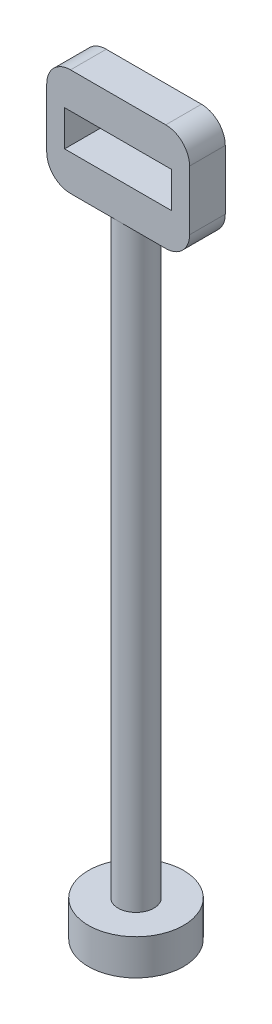
ISO-10303-21;
HEADER;
FILE_DESCRIPTION(('STEP AP214'),'2;1');
FILE_NAME('part.step','',(''),(''),'','','');
FILE_SCHEMA(('AUTOMOTIVE_DESIGN { 1 0 10303 214 1 1 1 1 }'));
ENDSEC;
DATA;
#1=APPLICATION_CONTEXT('core data for automotive mechanical design processes');
#2=APPLICATION_PROTOCOL_DEFINITION('international standard','automotive_design',2000,#1);
#3=PRODUCT_CONTEXT('',#1,'mechanical');
#4=PRODUCT('Part','Part','',(#3));
#5=PRODUCT_RELATED_PRODUCT_CATEGORY('part','',(#4));
#6=PRODUCT_DEFINITION_FORMATION('','',#4);
#7=PRODUCT_DEFINITION_CONTEXT('part definition',#1,'design');
#8=PRODUCT_DEFINITION('design','',#6,#7);
#9=PRODUCT_DEFINITION_SHAPE('','',#8);
#10=(LENGTH_UNIT() NAMED_UNIT(*) SI_UNIT(.MILLI.,.METRE.));
#11=(NAMED_UNIT(*) PLANE_ANGLE_UNIT() SI_UNIT($,.RADIAN.));
#12=(NAMED_UNIT(*) SI_UNIT($,.STERADIAN.) SOLID_ANGLE_UNIT());
#13=UNCERTAINTY_MEASURE_WITH_UNIT(LENGTH_MEASURE(1.E-05),#10,'distance_accuracy_value','');
#14=(GEOMETRIC_REPRESENTATION_CONTEXT(3) GLOBAL_UNCERTAINTY_ASSIGNED_CONTEXT((#13)) GLOBAL_UNIT_ASSIGNED_CONTEXT((#10,
#11,#12)) REPRESENTATION_CONTEXT('',''));
#15=CARTESIAN_POINT('',(0.,0.,0.));
#16=DIRECTION('',(0.,0.,1.));
#17=DIRECTION('',(1.,0.,0.));
#18=AXIS2_PLACEMENT_3D('',#15,#16,#17);
#19=CARTESIAN_POINT('',(0.,50.,0.));
#20=DIRECTION('',(0.,-1.,0.));
#21=DIRECTION('',(0.,0.,-1.));
#22=AXIS2_PLACEMENT_3D('',#19,#20,#21);
#23=CYLINDRICAL_SURFACE('',#22,1.5);
#24=CARTESIAN_POINT('',(0.,50.,0.));
#25=DIRECTION('',(0.,1.,0.));
#26=DIRECTION('',(0.,0.,1.));
#27=AXIS2_PLACEMENT_3D('',#24,#25,#26);
#28=CIRCLE('',#27,1.5);
#29=CARTESIAN_POINT('',(0.,50.,1.5));
#30=VERTEX_POINT('',#29);
#31=CARTESIAN_POINT('',(0.,50.,-1.5));
#32=VERTEX_POINT('',#31);
#33=EDGE_CURVE('E205',#30,#32,#28,.T.);
#34=ORIENTED_EDGE('',*,*,#33,.F.);
#35=EDGE_CURVE('E204',#32,#30,#28,.T.);
#36=ORIENTED_EDGE('',*,*,#35,.F.);
#37=EDGE_LOOP('',(#34,#36));
#38=FACE_BOUND('',#37,.T.);
#39=CARTESIAN_POINT('',(0.,0.,0.));
#40=DIRECTION('',(0.,-1.,0.));
#41=DIRECTION('',(0.,0.,-1.));
#42=AXIS2_PLACEMENT_3D('',#39,#40,#41);
#43=CIRCLE('',#42,1.5);
#44=CARTESIAN_POINT('',(0.,0.,-1.5));
#45=VERTEX_POINT('',#44);
#46=EDGE_CURVE('E199',#45,#45,#43,.T.);
#47=ORIENTED_EDGE('',*,*,#46,.F.);
#48=EDGE_LOOP('',(#47));
#49=FACE_BOUND('',#48,.T.);
#50=ADVANCED_FACE('F33',(#38,#49),#23,.T.);
#51=CARTESIAN_POINT('',(0.,-3.,0.));
#52=DIRECTION('',(0.,1.,0.));
#53=DIRECTION('',(0.,0.,1.));
#54=AXIS2_PLACEMENT_3D('',#51,#52,#53);
#55=CYLINDRICAL_SURFACE('',#54,4.);
#56=CARTESIAN_POINT('',(0.,-3.,0.));
#57=DIRECTION('',(0.,-1.,0.));
#58=DIRECTION('',(0.,0.,-1.));
#59=AXIS2_PLACEMENT_3D('',#56,#57,#58);
#60=CIRCLE('',#59,4.);
#61=CARTESIAN_POINT('',(0.,-3.,-4.));
#62=VERTEX_POINT('',#61);
#63=EDGE_CURVE('E196',#62,#62,#60,.T.);
#64=ORIENTED_EDGE('',*,*,#63,.F.);
#65=EDGE_LOOP('',(#64));
#66=FACE_BOUND('',#65,.T.);
#67=CARTESIAN_POINT('',(0.,0.,0.));
#68=DIRECTION('',(0.,-1.,0.));
#69=DIRECTION('',(0.,0.,-1.));
#70=AXIS2_PLACEMENT_3D('',#67,#68,#69);
#71=CIRCLE('',#70,4.);
#72=CARTESIAN_POINT('',(0.,0.,-4.));
#73=VERTEX_POINT('',#72);
#74=EDGE_CURVE('E184',#73,#73,#71,.T.);
#75=ORIENTED_EDGE('',*,*,#74,.T.);
#76=EDGE_LOOP('',(#75));
#77=FACE_BOUND('',#76,.T.);
#78=ADVANCED_FACE('F285',(#66,#77),#55,.T.);
#79=CARTESIAN_POINT('',(0.,-3.,0.));
#80=DIRECTION('',(0.,-1.,0.));
#81=DIRECTION('',(0.,0.,-1.));
#82=AXIS2_PLACEMENT_3D('',#79,#80,#81);
#83=PLANE('',#82);
#84=ORIENTED_EDGE('',*,*,#63,.T.);
#85=EDGE_LOOP('',(#84));
#86=FACE_BOUND('',#85,.T.);
#87=ADVANCED_FACE('F290',(#86),#83,.T.);
#88=CARTESIAN_POINT('',(0.,0.,0.));
#89=DIRECTION('',(0.,-1.,0.));
#90=DIRECTION('',(0.,0.,-1.));
#91=AXIS2_PLACEMENT_3D('',#88,#89,#90);
#92=PLANE('',#91);
#93=ORIENTED_EDGE('',*,*,#46,.T.);
#94=EDGE_LOOP('',(#93));
#95=FACE_BOUND('',#94,.T.);
#96=ORIENTED_EDGE('',*,*,#74,.F.);
#97=EDGE_LOOP('',(#96));
#98=FACE_BOUND('',#97,.T.);
#99=ADVANCED_FACE('F325',(#95,#98),#92,.F.);
#100=CARTESIAN_POINT('',(0.,50.,-1.5));
#101=DIRECTION('',(0.,-1.,0.));
#102=DIRECTION('',(0.,0.,-1.));
#103=AXIS2_PLACEMENT_3D('',#100,#101,#102);
#104=PLANE('',#103);
#105=DIRECTION('',(1.,0.,0.));
#106=VECTOR('',#105,1.);
#107=CARTESIAN_POINT('',(0.,50.,-1.5));
#108=LINE('',#107,#106);
#109=CARTESIAN_POINT('',(4.,50.,-1.5));
#110=VERTEX_POINT('',#109);
#111=EDGE_CURVE('E176',#32,#110,#108,.T.);
#112=ORIENTED_EDGE('',*,*,#111,.T.);
#113=DIRECTION('',(0.,0.,1.));
#114=VECTOR('',#113,1.);
#115=CARTESIAN_POINT('',(4.,50.,-1.5));
#116=LINE('',#115,#114);
#117=CARTESIAN_POINT('',(4.,50.,1.5));
#118=VERTEX_POINT('',#117);
#119=EDGE_CURVE('E41',#110,#118,#116,.T.);
#120=ORIENTED_EDGE('',*,*,#119,.T.);
#121=DIRECTION('',(1.,0.,0.));
#122=VECTOR('',#121,1.);
#123=CARTESIAN_POINT('',(0.,50.,1.5));
#124=LINE('',#123,#122);
#125=EDGE_CURVE('E172',#30,#118,#124,.T.);
#126=ORIENTED_EDGE('',*,*,#125,.F.);
#127=ORIENTED_EDGE('',*,*,#33,.T.);
#128=EDGE_LOOP('',(#112,#120,#126,#127));
#129=FACE_BOUND('',#128,.T.);
#130=ADVANCED_FACE('F241',(#129),#104,.T.);
#131=CARTESIAN_POINT('',(-6.,50.,-1.5));
#132=DIRECTION('',(-1.,0.,0.));
#133=DIRECTION('',(0.,0.,1.));
#134=AXIS2_PLACEMENT_3D('',#131,#132,#133);
#135=PLANE('',#134);
#136=DIRECTION('',(0.,-1.,0.));
#137=VECTOR('',#136,1.);
#138=CARTESIAN_POINT('',(-6.,50.,1.5));
#139=LINE('',#138,#137);
#140=CARTESIAN_POINT('',(-6.,57.,1.5));
#141=VERTEX_POINT('',#140);
#142=CARTESIAN_POINT('',(-6.,52.,1.5));
#143=VERTEX_POINT('',#142);
#144=EDGE_CURVE('E193',#141,#143,#139,.T.);
#145=ORIENTED_EDGE('',*,*,#144,.F.);
#146=DIRECTION('',(0.,0.,1.));
#147=VECTOR('',#146,1.);
#148=CARTESIAN_POINT('',(-6.,57.,-1.5));
#149=LINE('',#148,#147);
#150=CARTESIAN_POINT('',(-6.,57.,-1.5));
#151=VERTEX_POINT('',#150);
#152=EDGE_CURVE('E224',#141,#151,#149,.F.);
#153=ORIENTED_EDGE('',*,*,#152,.T.);
#154=DIRECTION('',(0.,-1.,0.));
#155=VECTOR('',#154,1.);
#156=CARTESIAN_POINT('',(-6.,50.,-1.5));
#157=LINE('',#156,#155);
#158=CARTESIAN_POINT('',(-6.,52.,-1.5));
#159=VERTEX_POINT('',#158);
#160=EDGE_CURVE('E181',#151,#159,#157,.T.);
#161=ORIENTED_EDGE('',*,*,#160,.T.);
#162=DIRECTION('',(0.,0.,1.));
#163=VECTOR('',#162,1.);
#164=CARTESIAN_POINT('',(-6.,52.,-1.5));
#165=LINE('',#164,#163);
#166=EDGE_CURVE('E221',#159,#143,#165,.T.);
#167=ORIENTED_EDGE('',*,*,#166,.T.);
#168=EDGE_LOOP('',(#145,#153,#161,#167));
#169=FACE_BOUND('',#168,.T.);
#170=ADVANCED_FACE('F261',(#169),#135,.T.);
#171=CARTESIAN_POINT('',(-6.,59.,-1.5));
#172=DIRECTION('',(0.,1.,0.));
#173=DIRECTION('',(0.,0.,1.));
#174=AXIS2_PLACEMENT_3D('',#171,#172,#173);
#175=PLANE('',#174);
#176=DIRECTION('',(-1.,0.,0.));
#177=VECTOR('',#176,1.);
#178=CARTESIAN_POINT('',(-6.,59.,-1.5));
#179=LINE('',#178,#177);
#180=CARTESIAN_POINT('',(4.,59.,-1.5));
#181=VERTEX_POINT('',#180);
#182=CARTESIAN_POINT('',(-4.,59.,-1.5));
#183=VERTEX_POINT('',#182);
#184=EDGE_CURVE('E178',#181,#183,#179,.T.);
#185=ORIENTED_EDGE('',*,*,#184,.T.);
#186=DIRECTION('',(0.,0.,1.));
#187=VECTOR('',#186,1.);
#188=CARTESIAN_POINT('',(-4.,59.,-1.5));
#189=LINE('',#188,#187);
#190=CARTESIAN_POINT('',(-4.,59.,1.5));
#191=VERTEX_POINT('',#190);
#192=EDGE_CURVE('E210',#183,#191,#189,.T.);
#193=ORIENTED_EDGE('',*,*,#192,.T.);
#194=DIRECTION('',(-1.,0.,0.));
#195=VECTOR('',#194,1.);
#196=CARTESIAN_POINT('',(-6.,59.,1.5));
#197=LINE('',#196,#195);
#198=CARTESIAN_POINT('',(4.,59.,1.5));
#199=VERTEX_POINT('',#198);
#200=EDGE_CURVE('E190',#199,#191,#197,.T.);
#201=ORIENTED_EDGE('',*,*,#200,.F.);
#202=DIRECTION('',(0.,0.,1.));
#203=VECTOR('',#202,1.);
#204=CARTESIAN_POINT('',(4.,59.,-1.5));
#205=LINE('',#204,#203);
#206=EDGE_CURVE('E208',#199,#181,#205,.F.);
#207=ORIENTED_EDGE('',*,*,#206,.T.);
#208=EDGE_LOOP('',(#185,#193,#201,#207));
#209=FACE_BOUND('',#208,.T.);
#210=ADVANCED_FACE('F269',(#209),#175,.T.);
#211=CARTESIAN_POINT('',(6.,59.,-1.5));
#212=DIRECTION('',(1.,0.,0.));
#213=DIRECTION('',(0.,0.,-1.));
#214=AXIS2_PLACEMENT_3D('',#211,#212,#213);
#215=PLANE('',#214);
#216=DIRECTION('',(0.,1.,0.));
#217=VECTOR('',#216,1.);
#218=CARTESIAN_POINT('',(6.,59.,-1.5));
#219=LINE('',#218,#217);
#220=CARTESIAN_POINT('',(6.,52.,-1.5));
#221=VERTEX_POINT('',#220);
#222=CARTESIAN_POINT('',(6.,57.,-1.5));
#223=VERTEX_POINT('',#222);
#224=EDGE_CURVE('E175',#221,#223,#219,.T.);
#225=ORIENTED_EDGE('',*,*,#224,.T.);
#226=DIRECTION('',(0.,0.,1.));
#227=VECTOR('',#226,1.);
#228=CARTESIAN_POINT('',(6.,57.,-1.5));
#229=LINE('',#228,#227);
#230=CARTESIAN_POINT('',(6.,57.,1.5));
#231=VERTEX_POINT('',#230);
#232=EDGE_CURVE('E234',#223,#231,#229,.T.);
#233=ORIENTED_EDGE('',*,*,#232,.T.);
#234=DIRECTION('',(0.,1.,0.));
#235=VECTOR('',#234,1.);
#236=CARTESIAN_POINT('',(6.,59.,1.5));
#237=LINE('',#236,#235);
#238=CARTESIAN_POINT('',(6.,52.,1.5));
#239=VERTEX_POINT('',#238);
#240=EDGE_CURVE('E187',#239,#231,#237,.T.);
#241=ORIENTED_EDGE('',*,*,#240,.F.);
#242=DIRECTION('',(0.,0.,1.));
#243=VECTOR('',#242,1.);
#244=CARTESIAN_POINT('',(6.,52.,-1.5));
#245=LINE('',#244,#243);
#246=EDGE_CURVE('E232',#239,#221,#245,.F.);
#247=ORIENTED_EDGE('',*,*,#246,.T.);
#248=EDGE_LOOP('',(#225,#233,#241,#247));
#249=FACE_BOUND('',#248,.T.);
#250=ADVANCED_FACE('F275',(#249),#215,.T.);
#251=CARTESIAN_POINT('',(-4.,50.,1.5));
#252=VERTEX_POINT('',#251);
#253=EDGE_CURVE('E185',#252,#30,#124,.T.);
#254=ORIENTED_EDGE('',*,*,#253,.F.);
#255=DIRECTION('',(0.,0.,1.));
#256=VECTOR('',#255,1.);
#257=CARTESIAN_POINT('',(-4.,50.,-1.5));
#258=LINE('',#257,#256);
#259=CARTESIAN_POINT('',(-4.,50.,-1.5));
#260=VERTEX_POINT('',#259);
#261=EDGE_CURVE('E11',#252,#260,#258,.F.);
#262=ORIENTED_EDGE('',*,*,#261,.T.);
#263=EDGE_CURVE('E173',#260,#32,#108,.T.);
#264=ORIENTED_EDGE('',*,*,#263,.T.);
#265=ORIENTED_EDGE('',*,*,#35,.T.);
#266=EDGE_LOOP('',(#254,#262,#264,#265));
#267=FACE_BOUND('',#266,.T.);
#268=ADVANCED_FACE('F252',(#267),#104,.T.);
#269=CARTESIAN_POINT('',(0.,0.,-1.5));
#270=DIRECTION('',(0.,0.,-1.));
#271=DIRECTION('',(-1.,0.,0.));
#272=AXIS2_PLACEMENT_3D('',#269,#270,#271);
#273=PLANE('',#272);
#274=DIRECTION('',(1.,0.,0.));
#275=VECTOR('',#274,1.);
#276=CARTESIAN_POINT('',(0.,56.,-1.5));
#277=LINE('',#276,#275);
#278=CARTESIAN_POINT('',(-4.50000000000001,56.,-1.5));
#279=VERTEX_POINT('',#278);
#280=CARTESIAN_POINT('',(4.49999999999999,56.,-1.5));
#281=VERTEX_POINT('',#280);
#282=EDGE_CURVE('E170',#279,#281,#277,.T.);
#283=ORIENTED_EDGE('',*,*,#282,.F.);
#284=DIRECTION('',(0.,1.,0.));
#285=VECTOR('',#284,1.);
#286=CARTESIAN_POINT('',(-4.50000000000001,0.,-1.5));
#287=LINE('',#286,#285);
#288=CARTESIAN_POINT('',(-4.50000000000001,53.,-1.5));
#289=VERTEX_POINT('',#288);
#290=EDGE_CURVE('E162',#289,#279,#287,.T.);
#291=ORIENTED_EDGE('',*,*,#290,.F.);
#292=DIRECTION('',(1.,0.,0.));
#293=VECTOR('',#292,1.);
#294=CARTESIAN_POINT('',(0.,53.,-1.5));
#295=LINE('',#294,#293);
#296=CARTESIAN_POINT('',(4.49999999999999,53.,-1.5));
#297=VERTEX_POINT('',#296);
#298=EDGE_CURVE('E137',#289,#297,#295,.T.);
#299=ORIENTED_EDGE('',*,*,#298,.T.);
#300=DIRECTION('',(0.,1.,0.));
#301=VECTOR('',#300,1.);
#302=CARTESIAN_POINT('',(4.50000000000001,0.,-1.5));
#303=LINE('',#302,#301);
#304=EDGE_CURVE('E167',#297,#281,#303,.T.);
#305=ORIENTED_EDGE('',*,*,#304,.T.);
#306=EDGE_LOOP('',(#283,#291,#299,#305));
#307=FACE_BOUND('',#306,.T.);
#308=ORIENTED_EDGE('',*,*,#160,.F.);
#309=CARTESIAN_POINT('',(-4.,57.,-1.5));
#310=DIRECTION('',(0.,0.,-1.));
#311=DIRECTION('',(-1.,0.,0.));
#312=AXIS2_PLACEMENT_3D('',#309,#310,#311);
#313=CIRCLE('',#312,2.);
#314=EDGE_CURVE('E230',#151,#183,#313,.T.);
#315=ORIENTED_EDGE('',*,*,#314,.T.);
#316=ORIENTED_EDGE('',*,*,#184,.F.);
#317=CARTESIAN_POINT('',(4.,57.,-1.5));
#318=DIRECTION('',(0.,0.,-1.));
#319=DIRECTION('',(-1.,0.,0.));
#320=AXIS2_PLACEMENT_3D('',#317,#318,#319);
#321=CIRCLE('',#320,2.);
#322=EDGE_CURVE('E54',#181,#223,#321,.T.);
#323=ORIENTED_EDGE('',*,*,#322,.T.);
#324=ORIENTED_EDGE('',*,*,#224,.F.);
#325=CARTESIAN_POINT('',(4.,52.,-1.5));
#326=DIRECTION('',(0.,0.,-1.));
#327=DIRECTION('',(-1.,0.,0.));
#328=AXIS2_PLACEMENT_3D('',#325,#326,#327);
#329=CIRCLE('',#328,2.);
#330=EDGE_CURVE('E48',#221,#110,#329,.T.);
#331=ORIENTED_EDGE('',*,*,#330,.T.);
#332=ORIENTED_EDGE('',*,*,#111,.F.);
#333=ORIENTED_EDGE('',*,*,#263,.F.);
#334=CARTESIAN_POINT('',(-4.,52.,-1.5));
#335=DIRECTION('',(0.,0.,-1.));
#336=DIRECTION('',(-1.,0.,0.));
#337=AXIS2_PLACEMENT_3D('',#334,#335,#336);
#338=CIRCLE('',#337,2.);
#339=EDGE_CURVE('E226',#260,#159,#338,.T.);
#340=ORIENTED_EDGE('',*,*,#339,.T.);
#341=EDGE_LOOP('',(#308,#315,#316,#323,#324,#331,#332,#333,#340));
#342=FACE_BOUND('',#341,.T.);
#343=ADVANCED_FACE('F256',(#307,#342),#273,.T.);
#344=CARTESIAN_POINT('',(0.,0.,1.5));
#345=DIRECTION('',(0.,0.,-1.));
#346=DIRECTION('',(-1.,0.,0.));
#347=AXIS2_PLACEMENT_3D('',#344,#345,#346);
#348=PLANE('',#347);
#349=DIRECTION('',(0.,-1.,0.));
#350=VECTOR('',#349,1.);
#351=CARTESIAN_POINT('',(-4.50000000000001,0.,1.5));
#352=LINE('',#351,#350);
#353=CARTESIAN_POINT('',(-4.50000000000001,56.,1.5));
#354=VERTEX_POINT('',#353);
#355=CARTESIAN_POINT('',(-4.50000000000001,53.,1.5));
#356=VERTEX_POINT('',#355);
#357=EDGE_CURVE('E145',#354,#356,#352,.T.);
#358=ORIENTED_EDGE('',*,*,#357,.F.);
#359=DIRECTION('',(-1.,0.,0.));
#360=VECTOR('',#359,1.);
#361=CARTESIAN_POINT('',(0.,56.,1.5));
#362=LINE('',#361,#360);
#363=CARTESIAN_POINT('',(4.49999999999999,56.,1.5));
#364=VERTEX_POINT('',#363);
#365=EDGE_CURVE('E150',#364,#354,#362,.T.);
#366=ORIENTED_EDGE('',*,*,#365,.F.);
#367=DIRECTION('',(0.,-1.,0.));
#368=VECTOR('',#367,1.);
#369=CARTESIAN_POINT('',(4.50000000000001,0.,1.5));
#370=LINE('',#369,#368);
#371=CARTESIAN_POINT('',(4.49999999999999,53.,1.5));
#372=VERTEX_POINT('',#371);
#373=EDGE_CURVE('E155',#364,#372,#370,.T.);
#374=ORIENTED_EDGE('',*,*,#373,.T.);
#375=DIRECTION('',(-1.,0.,0.));
#376=VECTOR('',#375,1.);
#377=CARTESIAN_POINT('',(0.,53.,1.5));
#378=LINE('',#377,#376);
#379=EDGE_CURVE('E134',#372,#356,#378,.T.);
#380=ORIENTED_EDGE('',*,*,#379,.T.);
#381=EDGE_LOOP('',(#358,#366,#374,#380));
#382=FACE_BOUND('',#381,.T.);
#383=ORIENTED_EDGE('',*,*,#200,.T.);
#384=CARTESIAN_POINT('',(-4.,57.,1.5));
#385=DIRECTION('',(0.,0.,-1.));
#386=DIRECTION('',(-1.,0.,0.));
#387=AXIS2_PLACEMENT_3D('',#384,#385,#386);
#388=CIRCLE('',#387,2.);
#389=EDGE_CURVE('E219',#191,#141,#388,.F.);
#390=ORIENTED_EDGE('',*,*,#389,.T.);
#391=ORIENTED_EDGE('',*,*,#144,.T.);
#392=CARTESIAN_POINT('',(-4.,52.,1.5));
#393=DIRECTION('',(0.,0.,-1.));
#394=DIRECTION('',(-1.,0.,0.));
#395=AXIS2_PLACEMENT_3D('',#392,#393,#394);
#396=CIRCLE('',#395,2.);
#397=EDGE_CURVE('E213',#143,#252,#396,.F.);
#398=ORIENTED_EDGE('',*,*,#397,.T.);
#399=ORIENTED_EDGE('',*,*,#253,.T.);
#400=ORIENTED_EDGE('',*,*,#125,.T.);
#401=CARTESIAN_POINT('',(4.,52.,1.5));
#402=DIRECTION('',(0.,0.,-1.));
#403=DIRECTION('',(-1.,0.,0.));
#404=AXIS2_PLACEMENT_3D('',#401,#402,#403);
#405=CIRCLE('',#404,2.);
#406=EDGE_CURVE('E215',#118,#239,#405,.F.);
#407=ORIENTED_EDGE('',*,*,#406,.T.);
#408=ORIENTED_EDGE('',*,*,#240,.T.);
#409=CARTESIAN_POINT('',(4.,57.,1.5));
#410=DIRECTION('',(0.,0.,-1.));
#411=DIRECTION('',(-1.,0.,0.));
#412=AXIS2_PLACEMENT_3D('',#409,#410,#411);
#413=CIRCLE('',#412,2.);
#414=EDGE_CURVE('E217',#231,#199,#413,.F.);
#415=ORIENTED_EDGE('',*,*,#414,.T.);
#416=EDGE_LOOP('',(#383,#390,#391,#398,#399,#400,#407,#408,#415));
#417=FACE_BOUND('',#416,.T.);
#418=ADVANCED_FACE('F152',(#382,#417),#348,.F.);
#419=CARTESIAN_POINT('',(0.,56.,-2.5));
#420=DIRECTION('',(0.,1.,0.));
#421=DIRECTION('',(0.,0.,1.));
#422=AXIS2_PLACEMENT_3D('',#419,#420,#421);
#423=PLANE('',#422);
#424=ORIENTED_EDGE('',*,*,#282,.T.);
#425=DIRECTION('',(0.,0.,1.));
#426=VECTOR('',#425,1.);
#427=CARTESIAN_POINT('',(4.49999999999999,56.,-2.5));
#428=LINE('',#427,#426);
#429=EDGE_CURVE('E160',#281,#364,#428,.T.);
#430=ORIENTED_EDGE('',*,*,#429,.T.);
#431=ORIENTED_EDGE('',*,*,#365,.T.);
#432=DIRECTION('',(0.,0.,1.));
#433=VECTOR('',#432,1.);
#434=CARTESIAN_POINT('',(-4.50000000000001,56.,-2.5));
#435=LINE('',#434,#433);
#436=EDGE_CURVE('E141',#279,#354,#435,.T.);
#437=ORIENTED_EDGE('',*,*,#436,.F.);
#438=EDGE_LOOP('',(#424,#430,#431,#437));
#439=FACE_BOUND('',#438,.T.);
#440=ADVANCED_FACE('F307',(#439),#423,.F.);
#441=CARTESIAN_POINT('',(4.50000000000001,0.,-2.5));
#442=DIRECTION('',(-1.,0.,0.));
#443=DIRECTION('',(0.,-1.,0.));
#444=AXIS2_PLACEMENT_3D('',#441,#442,#443);
#445=PLANE('',#444);
#446=DIRECTION('',(0.,0.,1.));
#447=VECTOR('',#446,1.);
#448=CARTESIAN_POINT('',(4.49999999999999,53.,-2.5));
#449=LINE('',#448,#447);
#450=EDGE_CURVE('E140',#297,#372,#449,.T.);
#451=ORIENTED_EDGE('',*,*,#450,.T.);
#452=ORIENTED_EDGE('',*,*,#373,.F.);
#453=ORIENTED_EDGE('',*,*,#429,.F.);
#454=ORIENTED_EDGE('',*,*,#304,.F.);
#455=EDGE_LOOP('',(#451,#452,#453,#454));
#456=FACE_BOUND('',#455,.T.);
#457=ADVANCED_FACE('F303',(#456),#445,.T.);
#458=CARTESIAN_POINT('',(0.,53.,-2.5));
#459=DIRECTION('',(0.,1.,0.));
#460=DIRECTION('',(0.,0.,1.));
#461=AXIS2_PLACEMENT_3D('',#458,#459,#460);
#462=PLANE('',#461);
#463=DIRECTION('',(0.,0.,1.));
#464=VECTOR('',#463,1.);
#465=CARTESIAN_POINT('',(-4.50000000000001,53.,-2.5));
#466=LINE('',#465,#464);
#467=EDGE_CURVE('E129',#289,#356,#466,.T.);
#468=ORIENTED_EDGE('',*,*,#467,.T.);
#469=ORIENTED_EDGE('',*,*,#379,.F.);
#470=ORIENTED_EDGE('',*,*,#450,.F.);
#471=ORIENTED_EDGE('',*,*,#298,.F.);
#472=EDGE_LOOP('',(#468,#469,#470,#471));
#473=FACE_BOUND('',#472,.T.);
#474=ADVANCED_FACE('F131',(#473),#462,.T.);
#475=CARTESIAN_POINT('',(-4.50000000000001,0.,-2.5));
#476=DIRECTION('',(-1.,0.,0.));
#477=DIRECTION('',(0.,0.,1.));
#478=AXIS2_PLACEMENT_3D('',#475,#476,#477);
#479=PLANE('',#478);
#480=ORIENTED_EDGE('',*,*,#290,.T.);
#481=ORIENTED_EDGE('',*,*,#436,.T.);
#482=ORIENTED_EDGE('',*,*,#357,.T.);
#483=ORIENTED_EDGE('',*,*,#467,.F.);
#484=EDGE_LOOP('',(#480,#481,#482,#483));
#485=FACE_BOUND('',#484,.T.);
#486=ADVANCED_FACE('F146',(#485),#479,.F.);
#487=CARTESIAN_POINT('',(-4.,57.,-1.5));
#488=DIRECTION('',(0.,0.,1.));
#489=DIRECTION('',(1.,0.,0.));
#490=AXIS2_PLACEMENT_3D('',#487,#488,#489);
#491=CYLINDRICAL_SURFACE('',#490,2.);
#492=ORIENTED_EDGE('',*,*,#314,.F.);
#493=ORIENTED_EDGE('',*,*,#152,.F.);
#494=ORIENTED_EDGE('',*,*,#389,.F.);
#495=ORIENTED_EDGE('',*,*,#192,.F.);
#496=EDGE_LOOP('',(#492,#493,#494,#495));
#497=FACE_BOUND('',#496,.T.);
#498=ADVANCED_FACE('F267',(#497),#491,.T.);
#499=CARTESIAN_POINT('',(4.,57.,-1.5));
#500=DIRECTION('',(0.,0.,1.));
#501=DIRECTION('',(1.,0.,0.));
#502=AXIS2_PLACEMENT_3D('',#499,#500,#501);
#503=CYLINDRICAL_SURFACE('',#502,2.);
#504=ORIENTED_EDGE('',*,*,#322,.F.);
#505=ORIENTED_EDGE('',*,*,#206,.F.);
#506=ORIENTED_EDGE('',*,*,#414,.F.);
#507=ORIENTED_EDGE('',*,*,#232,.F.);
#508=EDGE_LOOP('',(#504,#505,#506,#507));
#509=FACE_BOUND('',#508,.T.);
#510=ADVANCED_FACE('F273',(#509),#503,.T.);
#511=CARTESIAN_POINT('',(4.,52.,-1.5));
#512=DIRECTION('',(0.,0.,1.));
#513=DIRECTION('',(1.,0.,0.));
#514=AXIS2_PLACEMENT_3D('',#511,#512,#513);
#515=CYLINDRICAL_SURFACE('',#514,2.);
#516=ORIENTED_EDGE('',*,*,#330,.F.);
#517=ORIENTED_EDGE('',*,*,#246,.F.);
#518=ORIENTED_EDGE('',*,*,#406,.F.);
#519=ORIENTED_EDGE('',*,*,#119,.F.);
#520=EDGE_LOOP('',(#516,#517,#518,#519));
#521=FACE_BOUND('',#520,.T.);
#522=ADVANCED_FACE('F277',(#521),#515,.T.);
#523=CARTESIAN_POINT('',(-4.,52.,-1.5));
#524=DIRECTION('',(0.,0.,1.));
#525=DIRECTION('',(1.,0.,0.));
#526=AXIS2_PLACEMENT_3D('',#523,#524,#525);
#527=CYLINDRICAL_SURFACE('',#526,2.);
#528=ORIENTED_EDGE('',*,*,#339,.F.);
#529=ORIENTED_EDGE('',*,*,#261,.F.);
#530=ORIENTED_EDGE('',*,*,#397,.F.);
#531=ORIENTED_EDGE('',*,*,#166,.F.);
#532=EDGE_LOOP('',(#528,#529,#530,#531));
#533=FACE_BOUND('',#532,.T.);
#534=ADVANCED_FACE('F35',(#533),#527,.T.);
#535=CLOSED_SHELL('',(#50,#78,#87,#99,#130,#170,#210,#250,#268,#343,#418,#440,#457,#474,#486,
#498,#510,#522,#534));
#536=MANIFOLD_SOLID_BREP('B2',#535);
#537=ADVANCED_BREP_SHAPE_REPRESENTATION('',(#18,#536),#14);
#538=SHAPE_DEFINITION_REPRESENTATION(#9,#537);
ENDSEC;
END-ISO-10303-21;
